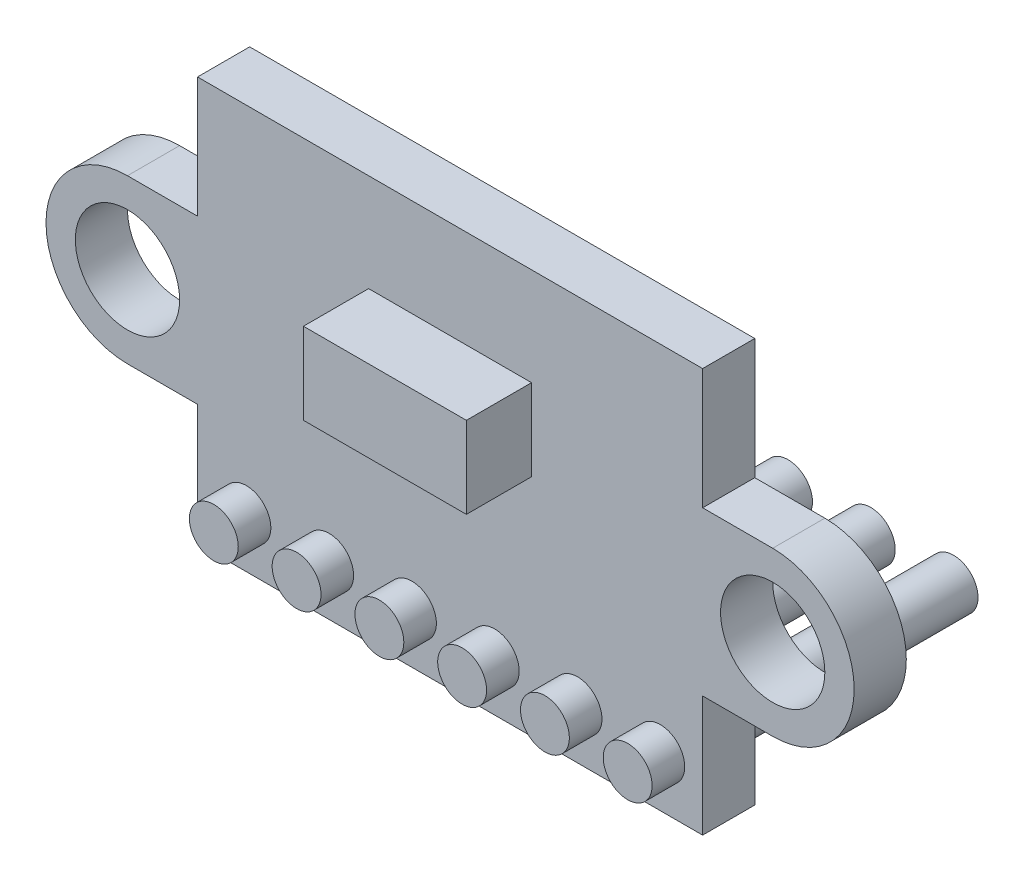
ISO-10303-21;
HEADER;
FILE_DESCRIPTION(('STEP AP214'),'2;1');
FILE_NAME('part.step','',(''),(''),'','','');
FILE_SCHEMA(('AUTOMOTIVE_DESIGN { 1 0 10303 214 1 1 1 1 }'));
ENDSEC;
DATA;
#1=APPLICATION_CONTEXT('core data for automotive mechanical design processes');
#2=APPLICATION_PROTOCOL_DEFINITION('international standard','automotive_design',2000,#1);
#3=PRODUCT_CONTEXT('',#1,'mechanical');
#4=PRODUCT('Part','Part','',(#3));
#5=PRODUCT_RELATED_PRODUCT_CATEGORY('part','',(#4));
#6=PRODUCT_DEFINITION_FORMATION('','',#4);
#7=PRODUCT_DEFINITION_CONTEXT('part definition',#1,'design');
#8=PRODUCT_DEFINITION('design','',#6,#7);
#9=PRODUCT_DEFINITION_SHAPE('','',#8);
#10=(LENGTH_UNIT() NAMED_UNIT(*) SI_UNIT(.MILLI.,.METRE.));
#11=(NAMED_UNIT(*) PLANE_ANGLE_UNIT() SI_UNIT($,.RADIAN.));
#12=(NAMED_UNIT(*) SI_UNIT($,.STERADIAN.) SOLID_ANGLE_UNIT());
#13=UNCERTAINTY_MEASURE_WITH_UNIT(LENGTH_MEASURE(1.E-05),#10,'distance_accuracy_value','');
#14=(GEOMETRIC_REPRESENTATION_CONTEXT(3) GLOBAL_UNCERTAINTY_ASSIGNED_CONTEXT((#13)) GLOBAL_UNIT_ASSIGNED_CONTEXT((#10,
#11,#12)) REPRESENTATION_CONTEXT('',''));
#15=CARTESIAN_POINT('',(0.,0.,0.));
#16=DIRECTION('',(0.,0.,1.));
#17=DIRECTION('',(1.,0.,0.));
#18=AXIS2_PLACEMENT_3D('',#15,#16,#17);
#19=CARTESIAN_POINT('',(-9.9,0.,1.6));
#20=DIRECTION('',(0.,0.,1.));
#21=DIRECTION('',(1.,0.,0.));
#22=AXIS2_PLACEMENT_3D('',#19,#20,#21);
#23=PLANE('',#22);
#24=CARTESIAN_POINT('',(6.45,-4.66,1.6));
#25=DIRECTION('',(0.,0.,1.));
#26=DIRECTION('',(1.,0.,0.));
#27=AXIS2_PLACEMENT_3D('',#24,#25,#26);
#28=CIRCLE('',#27,0.75);
#29=CARTESIAN_POINT('',(7.2,-4.66,1.6));
#30=VERTEX_POINT('',#29);
#31=EDGE_CURVE('E11',#30,#30,#28,.T.);
#32=ORIENTED_EDGE('',*,*,#31,.F.);
#33=EDGE_LOOP('',(#32));
#34=FACE_BOUND('',#33,.T.);
#35=CARTESIAN_POINT('',(3.91,-4.66,1.6));
#36=DIRECTION('',(0.,0.,1.));
#37=DIRECTION('',(1.,0.,0.));
#38=AXIS2_PLACEMENT_3D('',#35,#36,#37);
#39=CIRCLE('',#38,0.75);
#40=CARTESIAN_POINT('',(4.66,-4.66,1.6));
#41=VERTEX_POINT('',#40);
#42=EDGE_CURVE('E42',#41,#41,#39,.T.);
#43=ORIENTED_EDGE('',*,*,#42,.F.);
#44=EDGE_LOOP('',(#43));
#45=FACE_BOUND('',#44,.T.);
#46=CARTESIAN_POINT('',(1.37,-4.66,1.6));
#47=DIRECTION('',(0.,0.,1.));
#48=DIRECTION('',(1.,0.,0.));
#49=AXIS2_PLACEMENT_3D('',#46,#47,#48);
#50=CIRCLE('',#49,0.75);
#51=CARTESIAN_POINT('',(2.12,-4.66,1.6));
#52=VERTEX_POINT('',#51);
#53=EDGE_CURVE('E259',#52,#52,#50,.T.);
#54=ORIENTED_EDGE('',*,*,#53,.F.);
#55=EDGE_LOOP('',(#54));
#56=FACE_BOUND('',#55,.T.);
#57=CARTESIAN_POINT('',(-1.17,-4.66,1.6));
#58=DIRECTION('',(0.,0.,1.));
#59=DIRECTION('',(1.,0.,0.));
#60=AXIS2_PLACEMENT_3D('',#57,#58,#59);
#61=CIRCLE('',#60,0.75);
#62=CARTESIAN_POINT('',(-0.419999999999998,-4.66,1.6));
#63=VERTEX_POINT('',#62);
#64=EDGE_CURVE('E264',#63,#63,#61,.T.);
#65=ORIENTED_EDGE('',*,*,#64,.F.);
#66=EDGE_LOOP('',(#65));
#67=FACE_BOUND('',#66,.T.);
#68=CARTESIAN_POINT('',(-3.71,-4.66,1.6));
#69=DIRECTION('',(0.,0.,1.));
#70=DIRECTION('',(1.,0.,0.));
#71=AXIS2_PLACEMENT_3D('',#68,#69,#70);
#72=CIRCLE('',#71,0.75);
#73=CARTESIAN_POINT('',(-2.96,-4.66,1.6));
#74=VERTEX_POINT('',#73);
#75=EDGE_CURVE('E271',#74,#74,#72,.T.);
#76=ORIENTED_EDGE('',*,*,#75,.F.);
#77=EDGE_LOOP('',(#76));
#78=FACE_BOUND('',#77,.T.);
#79=CARTESIAN_POINT('',(-6.25,-4.66,1.6));
#80=DIRECTION('',(0.,0.,1.));
#81=DIRECTION('',(1.,0.,0.));
#82=AXIS2_PLACEMENT_3D('',#79,#80,#81);
#83=CIRCLE('',#82,0.75);
#84=CARTESIAN_POINT('',(-5.5,-4.66,1.6));
#85=VERTEX_POINT('',#84);
#86=EDGE_CURVE('E220',#85,#85,#83,.T.);
#87=ORIENTED_EDGE('',*,*,#86,.F.);
#88=EDGE_LOOP('',(#87));
#89=FACE_BOUND('',#88,.T.);
#90=CARTESIAN_POINT('',(9.9,0.,1.6));
#91=DIRECTION('',(0.,0.,1.));
#92=DIRECTION('',(1.,0.,0.));
#93=AXIS2_PLACEMENT_3D('',#90,#91,#92);
#94=CIRCLE('',#93,1.6);
#95=CARTESIAN_POINT('',(11.5,0.,1.6));
#96=VERTEX_POINT('',#95);
#97=EDGE_CURVE('E173',#96,#96,#94,.T.);
#98=ORIENTED_EDGE('',*,*,#97,.F.);
#99=EDGE_LOOP('',(#98));
#100=FACE_BOUND('',#99,.T.);
#101=DIRECTION('',(0.,-1.,0.));
#102=VECTOR('',#101,1.);
#103=CARTESIAN_POINT('',(-7.75,6.2,1.6));
#104=LINE('',#103,#102);
#105=CARTESIAN_POINT('',(-7.75,6.2,1.6));
#106=VERTEX_POINT('',#105);
#107=CARTESIAN_POINT('',(-7.75,2.5,1.6));
#108=VERTEX_POINT('',#107);
#109=EDGE_CURVE('E193',#106,#108,#104,.T.);
#110=ORIENTED_EDGE('',*,*,#109,.T.);
#111=DIRECTION('',(-1.,0.,0.));
#112=VECTOR('',#111,1.);
#113=CARTESIAN_POINT('',(-7.75,2.5,1.6));
#114=LINE('',#113,#112);
#115=CARTESIAN_POINT('',(-9.9,2.5,1.6));
#116=VERTEX_POINT('',#115);
#117=EDGE_CURVE('E113',#108,#116,#114,.T.);
#118=ORIENTED_EDGE('',*,*,#117,.T.);
#119=CARTESIAN_POINT('',(-9.9,0.,1.6));
#120=DIRECTION('',(0.,0.,1.));
#121=DIRECTION('',(1.,0.,0.));
#122=AXIS2_PLACEMENT_3D('',#119,#120,#121);
#123=CIRCLE('',#122,2.5);
#124=CARTESIAN_POINT('',(-9.9,-2.5,1.6));
#125=VERTEX_POINT('',#124);
#126=EDGE_CURVE('E328',#116,#125,#123,.T.);
#127=ORIENTED_EDGE('',*,*,#126,.T.);
#128=DIRECTION('',(1.,0.,0.));
#129=VECTOR('',#128,1.);
#130=CARTESIAN_POINT('',(-7.75,-2.5,1.6));
#131=LINE('',#130,#129);
#132=CARTESIAN_POINT('',(-7.75,-2.5,1.6));
#133=VERTEX_POINT('',#132);
#134=EDGE_CURVE('E330',#125,#133,#131,.T.);
#135=ORIENTED_EDGE('',*,*,#134,.T.);
#136=DIRECTION('',(0.,-1.,0.));
#137=VECTOR('',#136,1.);
#138=CARTESIAN_POINT('',(-7.75,-6.2,1.6));
#139=LINE('',#138,#137);
#140=CARTESIAN_POINT('',(-7.75,-6.2,1.6));
#141=VERTEX_POINT('',#140);
#142=EDGE_CURVE('E332',#133,#141,#139,.T.);
#143=ORIENTED_EDGE('',*,*,#142,.T.);
#144=DIRECTION('',(1.,0.,0.));
#145=VECTOR('',#144,1.);
#146=CARTESIAN_POINT('',(7.75,-6.2,1.6));
#147=LINE('',#146,#145);
#148=CARTESIAN_POINT('',(7.75,-6.2,1.6));
#149=VERTEX_POINT('',#148);
#150=EDGE_CURVE('E334',#141,#149,#147,.T.);
#151=ORIENTED_EDGE('',*,*,#150,.T.);
#152=DIRECTION('',(0.,1.,0.));
#153=VECTOR('',#152,1.);
#154=CARTESIAN_POINT('',(7.75,-2.5,1.6));
#155=LINE('',#154,#153);
#156=CARTESIAN_POINT('',(7.75,-2.5,1.6));
#157=VERTEX_POINT('',#156);
#158=EDGE_CURVE('E336',#149,#157,#155,.T.);
#159=ORIENTED_EDGE('',*,*,#158,.T.);
#160=DIRECTION('',(1.,0.,0.));
#161=VECTOR('',#160,1.);
#162=CARTESIAN_POINT('',(9.9,-2.5,1.6));
#163=LINE('',#162,#161);
#164=CARTESIAN_POINT('',(9.9,-2.5,1.6));
#165=VERTEX_POINT('',#164);
#166=EDGE_CURVE('E338',#157,#165,#163,.T.);
#167=ORIENTED_EDGE('',*,*,#166,.T.);
#168=CARTESIAN_POINT('',(9.9,0.,1.6));
#169=DIRECTION('',(0.,0.,1.));
#170=DIRECTION('',(-1.,0.,0.));
#171=AXIS2_PLACEMENT_3D('',#168,#169,#170);
#172=CIRCLE('',#171,2.5);
#173=CARTESIAN_POINT('',(9.9,2.5,1.6));
#174=VERTEX_POINT('',#173);
#175=EDGE_CURVE('E148',#165,#174,#172,.T.);
#176=ORIENTED_EDGE('',*,*,#175,.T.);
#177=DIRECTION('',(-1.,0.,0.));
#178=VECTOR('',#177,1.);
#179=CARTESIAN_POINT('',(7.74999999999999,2.5,1.6));
#180=LINE('',#179,#178);
#181=CARTESIAN_POINT('',(7.74999999999999,2.5,1.6));
#182=VERTEX_POINT('',#181);
#183=EDGE_CURVE('E141',#174,#182,#180,.T.);
#184=ORIENTED_EDGE('',*,*,#183,.T.);
#185=DIRECTION('',(0.,1.,0.));
#186=VECTOR('',#185,1.);
#187=CARTESIAN_POINT('',(7.74999999999999,6.2,1.6));
#188=LINE('',#187,#186);
#189=CARTESIAN_POINT('',(7.74999999999999,6.2,1.6));
#190=VERTEX_POINT('',#189);
#191=EDGE_CURVE('E145',#182,#190,#188,.T.);
#192=ORIENTED_EDGE('',*,*,#191,.T.);
#193=DIRECTION('',(-1.,0.,0.));
#194=VECTOR('',#193,1.);
#195=CARTESIAN_POINT('',(-7.75,6.2,1.6));
#196=LINE('',#195,#194);
#197=EDGE_CURVE('E59',#190,#106,#196,.T.);
#198=ORIENTED_EDGE('',*,*,#197,.T.);
#199=EDGE_LOOP('',(#110,#118,#127,#135,#143,#151,#159,#167,#176,#184,#192,#198));
#200=FACE_BOUND('',#199,.T.);
#201=CARTESIAN_POINT('',(-9.9,0.,1.6));
#202=DIRECTION('',(0.,0.,1.));
#203=DIRECTION('',(1.,0.,0.));
#204=AXIS2_PLACEMENT_3D('',#201,#202,#203);
#205=CIRCLE('',#204,1.6);
#206=CARTESIAN_POINT('',(-8.3,0.,1.6));
#207=VERTEX_POINT('',#206);
#208=EDGE_CURVE('E316',#207,#207,#205,.T.);
#209=ORIENTED_EDGE('',*,*,#208,.F.);
#210=EDGE_LOOP('',(#209));
#211=FACE_BOUND('',#210,.T.);
#212=DIRECTION('',(1.,0.,0.));
#213=VECTOR('',#212,1.);
#214=CARTESIAN_POINT('',(-2.5,0.7,1.6));
#215=LINE('',#214,#213);
#216=CARTESIAN_POINT('',(-2.5,0.7,1.6));
#217=VERTEX_POINT('',#216);
#218=CARTESIAN_POINT('',(2.5,0.7,1.6));
#219=VERTEX_POINT('',#218);
#220=EDGE_CURVE('E300',#217,#219,#215,.T.);
#221=ORIENTED_EDGE('',*,*,#220,.F.);
#222=DIRECTION('',(0.,-1.,0.));
#223=VECTOR('',#222,1.);
#224=CARTESIAN_POINT('',(-2.5,3.2,1.6));
#225=LINE('',#224,#223);
#226=CARTESIAN_POINT('',(-2.5,3.2,1.6));
#227=VERTEX_POINT('',#226);
#228=EDGE_CURVE('E224',#227,#217,#225,.T.);
#229=ORIENTED_EDGE('',*,*,#228,.F.);
#230=DIRECTION('',(-1.,0.,0.));
#231=VECTOR('',#230,1.);
#232=CARTESIAN_POINT('',(-2.5,3.2,1.6));
#233=LINE('',#232,#231);
#234=CARTESIAN_POINT('',(2.5,3.2,1.6));
#235=VERTEX_POINT('',#234);
#236=EDGE_CURVE('E288',#235,#227,#233,.T.);
#237=ORIENTED_EDGE('',*,*,#236,.F.);
#238=DIRECTION('',(0.,1.,0.));
#239=VECTOR('',#238,1.);
#240=CARTESIAN_POINT('',(2.5,3.2,1.6));
#241=LINE('',#240,#239);
#242=EDGE_CURVE('E303',#219,#235,#241,.T.);
#243=ORIENTED_EDGE('',*,*,#242,.F.);
#244=EDGE_LOOP('',(#221,#229,#237,#243));
#245=FACE_BOUND('',#244,.T.);
#246=ADVANCED_FACE('F33',(#34,#45,#56,#67,#78,#89,#100,#200,#211,#245),#23,.T.);
#247=CARTESIAN_POINT('',(-9.9,0.,0.));
#248=DIRECTION('',(0.,0.,1.));
#249=DIRECTION('',(1.,0.,0.));
#250=AXIS2_PLACEMENT_3D('',#247,#248,#249);
#251=PLANE('',#250);
#252=CARTESIAN_POINT('',(6.45,-4.66,0.));
#253=DIRECTION('',(0.,0.,1.));
#254=DIRECTION('',(1.,0.,0.));
#255=AXIS2_PLACEMENT_3D('',#252,#253,#254);
#256=CIRCLE('',#255,0.75);
#257=CARTESIAN_POINT('',(7.2,-4.66,0.));
#258=VERTEX_POINT('',#257);
#259=EDGE_CURVE('E37',#258,#258,#256,.T.);
#260=ORIENTED_EDGE('',*,*,#259,.T.);
#261=EDGE_LOOP('',(#260));
#262=FACE_BOUND('',#261,.T.);
#263=CARTESIAN_POINT('',(3.91,-4.66,0.));
#264=DIRECTION('',(0.,0.,1.));
#265=DIRECTION('',(1.,0.,0.));
#266=AXIS2_PLACEMENT_3D('',#263,#264,#265);
#267=CIRCLE('',#266,0.75);
#268=CARTESIAN_POINT('',(4.66,-4.66,0.));
#269=VERTEX_POINT('',#268);
#270=EDGE_CURVE('E240',#269,#269,#267,.T.);
#271=ORIENTED_EDGE('',*,*,#270,.T.);
#272=EDGE_LOOP('',(#271));
#273=FACE_BOUND('',#272,.T.);
#274=CARTESIAN_POINT('',(1.37,-4.66,0.));
#275=DIRECTION('',(0.,0.,1.));
#276=DIRECTION('',(1.,0.,0.));
#277=AXIS2_PLACEMENT_3D('',#274,#275,#276);
#278=CIRCLE('',#277,0.75);
#279=CARTESIAN_POINT('',(2.12,-4.66,0.));
#280=VERTEX_POINT('',#279);
#281=EDGE_CURVE('E236',#280,#280,#278,.T.);
#282=ORIENTED_EDGE('',*,*,#281,.T.);
#283=EDGE_LOOP('',(#282));
#284=FACE_BOUND('',#283,.T.);
#285=CARTESIAN_POINT('',(-1.17,-4.66,0.));
#286=DIRECTION('',(0.,0.,1.));
#287=DIRECTION('',(1.,0.,0.));
#288=AXIS2_PLACEMENT_3D('',#285,#286,#287);
#289=CIRCLE('',#288,0.75);
#290=CARTESIAN_POINT('',(-0.419999999999998,-4.66,0.));
#291=VERTEX_POINT('',#290);
#292=EDGE_CURVE('E231',#291,#291,#289,.T.);
#293=ORIENTED_EDGE('',*,*,#292,.T.);
#294=EDGE_LOOP('',(#293));
#295=FACE_BOUND('',#294,.T.);
#296=CARTESIAN_POINT('',(-3.71,-4.66,0.));
#297=DIRECTION('',(0.,0.,1.));
#298=DIRECTION('',(1.,0.,0.));
#299=AXIS2_PLACEMENT_3D('',#296,#297,#298);
#300=CIRCLE('',#299,0.75);
#301=CARTESIAN_POINT('',(-2.96,-4.66,0.));
#302=VERTEX_POINT('',#301);
#303=EDGE_CURVE('E226',#302,#302,#300,.T.);
#304=ORIENTED_EDGE('',*,*,#303,.T.);
#305=EDGE_LOOP('',(#304));
#306=FACE_BOUND('',#305,.T.);
#307=CARTESIAN_POINT('',(-6.25,-4.66,0.));
#308=DIRECTION('',(0.,0.,1.));
#309=DIRECTION('',(1.,0.,0.));
#310=AXIS2_PLACEMENT_3D('',#307,#308,#309);
#311=CIRCLE('',#310,0.75);
#312=CARTESIAN_POINT('',(-5.5,-4.66,0.));
#313=VERTEX_POINT('',#312);
#314=EDGE_CURVE('E221',#313,#313,#311,.T.);
#315=ORIENTED_EDGE('',*,*,#314,.T.);
#316=EDGE_LOOP('',(#315));
#317=FACE_BOUND('',#316,.T.);
#318=DIRECTION('',(0.,-1.,0.));
#319=VECTOR('',#318,1.);
#320=CARTESIAN_POINT('',(-7.75,6.2,0.));
#321=LINE('',#320,#319);
#322=CARTESIAN_POINT('',(-7.75,6.2,0.));
#323=VERTEX_POINT('',#322);
#324=CARTESIAN_POINT('',(-7.75,2.5,0.));
#325=VERTEX_POINT('',#324);
#326=EDGE_CURVE('E169',#323,#325,#321,.T.);
#327=ORIENTED_EDGE('',*,*,#326,.F.);
#328=DIRECTION('',(-1.,0.,0.));
#329=VECTOR('',#328,1.);
#330=CARTESIAN_POINT('',(-7.75,6.2,0.));
#331=LINE('',#330,#329);
#332=CARTESIAN_POINT('',(7.74999999999999,6.2,0.));
#333=VERTEX_POINT('',#332);
#334=EDGE_CURVE('E104',#333,#323,#331,.T.);
#335=ORIENTED_EDGE('',*,*,#334,.F.);
#336=DIRECTION('',(0.,1.,0.));
#337=VECTOR('',#336,1.);
#338=CARTESIAN_POINT('',(7.74999999999999,6.2,0.));
#339=LINE('',#338,#337);
#340=CARTESIAN_POINT('',(7.74999999999999,2.5,0.));
#341=VERTEX_POINT('',#340);
#342=EDGE_CURVE('E190',#341,#333,#339,.T.);
#343=ORIENTED_EDGE('',*,*,#342,.F.);
#344=DIRECTION('',(-1.,0.,0.));
#345=VECTOR('',#344,1.);
#346=CARTESIAN_POINT('',(7.74999999999999,2.5,0.));
#347=LINE('',#346,#345);
#348=CARTESIAN_POINT('',(9.9,2.5,0.));
#349=VERTEX_POINT('',#348);
#350=EDGE_CURVE('E157',#349,#341,#347,.T.);
#351=ORIENTED_EDGE('',*,*,#350,.F.);
#352=CARTESIAN_POINT('',(9.9,0.,0.));
#353=DIRECTION('',(0.,0.,1.));
#354=DIRECTION('',(-1.,0.,0.));
#355=AXIS2_PLACEMENT_3D('',#352,#353,#354);
#356=CIRCLE('',#355,2.5);
#357=CARTESIAN_POINT('',(9.9,-2.5,0.));
#358=VERTEX_POINT('',#357);
#359=EDGE_CURVE('E187',#358,#349,#356,.T.);
#360=ORIENTED_EDGE('',*,*,#359,.F.);
#361=DIRECTION('',(1.,0.,0.));
#362=VECTOR('',#361,1.);
#363=CARTESIAN_POINT('',(9.9,-2.5,0.));
#364=LINE('',#363,#362);
#365=CARTESIAN_POINT('',(7.75,-2.5,0.));
#366=VERTEX_POINT('',#365);
#367=EDGE_CURVE('E185',#366,#358,#364,.T.);
#368=ORIENTED_EDGE('',*,*,#367,.F.);
#369=DIRECTION('',(0.,1.,0.));
#370=VECTOR('',#369,1.);
#371=CARTESIAN_POINT('',(7.75,-2.5,0.));
#372=LINE('',#371,#370);
#373=CARTESIAN_POINT('',(7.75,-6.2,0.));
#374=VERTEX_POINT('',#373);
#375=EDGE_CURVE('E183',#374,#366,#372,.T.);
#376=ORIENTED_EDGE('',*,*,#375,.F.);
#377=DIRECTION('',(1.,0.,0.));
#378=VECTOR('',#377,1.);
#379=CARTESIAN_POINT('',(7.75,-6.2,0.));
#380=LINE('',#379,#378);
#381=CARTESIAN_POINT('',(-7.75,-6.2,0.));
#382=VERTEX_POINT('',#381);
#383=EDGE_CURVE('E181',#382,#374,#380,.T.);
#384=ORIENTED_EDGE('',*,*,#383,.F.);
#385=DIRECTION('',(0.,-1.,0.));
#386=VECTOR('',#385,1.);
#387=CARTESIAN_POINT('',(-7.75,-6.2,0.));
#388=LINE('',#387,#386);
#389=CARTESIAN_POINT('',(-7.75,-2.5,0.));
#390=VERTEX_POINT('',#389);
#391=EDGE_CURVE('E179',#390,#382,#388,.T.);
#392=ORIENTED_EDGE('',*,*,#391,.F.);
#393=DIRECTION('',(1.,0.,0.));
#394=VECTOR('',#393,1.);
#395=CARTESIAN_POINT('',(-7.75,-2.5,0.));
#396=LINE('',#395,#394);
#397=CARTESIAN_POINT('',(-9.9,-2.5,0.));
#398=VERTEX_POINT('',#397);
#399=EDGE_CURVE('E177',#398,#390,#396,.T.);
#400=ORIENTED_EDGE('',*,*,#399,.F.);
#401=CARTESIAN_POINT('',(-9.9,0.,0.));
#402=DIRECTION('',(0.,0.,1.));
#403=DIRECTION('',(1.,0.,0.));
#404=AXIS2_PLACEMENT_3D('',#401,#402,#403);
#405=CIRCLE('',#404,2.5);
#406=CARTESIAN_POINT('',(-9.9,2.5,0.));
#407=VERTEX_POINT('',#406);
#408=EDGE_CURVE('E175',#407,#398,#405,.T.);
#409=ORIENTED_EDGE('',*,*,#408,.F.);
#410=DIRECTION('',(-1.,0.,0.));
#411=VECTOR('',#410,1.);
#412=CARTESIAN_POINT('',(-7.75,2.5,0.));
#413=LINE('',#412,#411);
#414=EDGE_CURVE('E172',#325,#407,#413,.T.);
#415=ORIENTED_EDGE('',*,*,#414,.F.);
#416=EDGE_LOOP('',(#327,#335,#343,#351,#360,#368,#376,#384,#392,#400,#409,#415));
#417=FACE_BOUND('',#416,.T.);
#418=CARTESIAN_POINT('',(9.9,0.,0.));
#419=DIRECTION('',(0.,0.,1.));
#420=DIRECTION('',(1.,0.,0.));
#421=AXIS2_PLACEMENT_3D('',#418,#419,#420);
#422=CIRCLE('',#421,1.6);
#423=CARTESIAN_POINT('',(11.5,0.,0.));
#424=VERTEX_POINT('',#423);
#425=EDGE_CURVE('E319',#424,#424,#422,.T.);
#426=ORIENTED_EDGE('',*,*,#425,.T.);
#427=EDGE_LOOP('',(#426));
#428=FACE_BOUND('',#427,.T.);
#429=CARTESIAN_POINT('',(-9.9,0.,0.));
#430=DIRECTION('',(0.,0.,1.));
#431=DIRECTION('',(1.,0.,0.));
#432=AXIS2_PLACEMENT_3D('',#429,#430,#431);
#433=CIRCLE('',#432,1.6);
#434=CARTESIAN_POINT('',(-8.3,0.,0.));
#435=VERTEX_POINT('',#434);
#436=EDGE_CURVE('E315',#435,#435,#433,.T.);
#437=ORIENTED_EDGE('',*,*,#436,.T.);
#438=EDGE_LOOP('',(#437));
#439=FACE_BOUND('',#438,.T.);
#440=ADVANCED_FACE('F351',(#262,#273,#284,#295,#306,#317,#417,#428,#439),#251,.F.);
#441=CARTESIAN_POINT('',(-7.75,6.2,1.6));
#442=DIRECTION('',(1.,0.,0.));
#443=DIRECTION('',(0.,0.,-1.));
#444=AXIS2_PLACEMENT_3D('',#441,#442,#443);
#445=PLANE('',#444);
#446=ORIENTED_EDGE('',*,*,#326,.T.);
#447=DIRECTION('',(0.,0.,-1.));
#448=VECTOR('',#447,1.);
#449=CARTESIAN_POINT('',(-7.75,2.5,1.6));
#450=LINE('',#449,#448);
#451=EDGE_CURVE('E218',#108,#325,#450,.T.);
#452=ORIENTED_EDGE('',*,*,#451,.F.);
#453=ORIENTED_EDGE('',*,*,#109,.F.);
#454=DIRECTION('',(0.,0.,-1.));
#455=VECTOR('',#454,1.);
#456=CARTESIAN_POINT('',(-7.75,6.2,1.6));
#457=LINE('',#456,#455);
#458=EDGE_CURVE('E165',#106,#323,#457,.T.);
#459=ORIENTED_EDGE('',*,*,#458,.T.);
#460=EDGE_LOOP('',(#446,#452,#453,#459));
#461=FACE_BOUND('',#460,.T.);
#462=ADVANCED_FACE('F35',(#461),#445,.F.);
#463=CARTESIAN_POINT('',(-7.75,2.5,1.6));
#464=DIRECTION('',(0.,-1.,0.));
#465=DIRECTION('',(0.,0.,-1.));
#466=AXIS2_PLACEMENT_3D('',#463,#464,#465);
#467=PLANE('',#466);
#468=ORIENTED_EDGE('',*,*,#414,.T.);
#469=DIRECTION('',(0.,0.,-1.));
#470=VECTOR('',#469,1.);
#471=CARTESIAN_POINT('',(-9.9,2.5,1.6));
#472=LINE('',#471,#470);
#473=EDGE_CURVE('E215',#116,#407,#472,.T.);
#474=ORIENTED_EDGE('',*,*,#473,.F.);
#475=ORIENTED_EDGE('',*,*,#117,.F.);
#476=ORIENTED_EDGE('',*,*,#451,.T.);
#477=EDGE_LOOP('',(#468,#474,#475,#476));
#478=FACE_BOUND('',#477,.T.);
#479=ADVANCED_FACE('F359',(#478),#467,.F.);
#480=CARTESIAN_POINT('',(-9.9,0.,1.6));
#481=DIRECTION('',(0.,0.,-1.));
#482=DIRECTION('',(-1.,0.,0.));
#483=AXIS2_PLACEMENT_3D('',#480,#481,#482);
#484=CYLINDRICAL_SURFACE('',#483,2.5);
#485=ORIENTED_EDGE('',*,*,#408,.T.);
#486=DIRECTION('',(0.,0.,-1.));
#487=VECTOR('',#486,1.);
#488=CARTESIAN_POINT('',(-9.9,-2.5,1.6));
#489=LINE('',#488,#487);
#490=EDGE_CURVE('E212',#125,#398,#489,.T.);
#491=ORIENTED_EDGE('',*,*,#490,.F.);
#492=ORIENTED_EDGE('',*,*,#126,.F.);
#493=ORIENTED_EDGE('',*,*,#473,.T.);
#494=EDGE_LOOP('',(#485,#491,#492,#493));
#495=FACE_BOUND('',#494,.T.);
#496=ADVANCED_FACE('F362',(#495),#484,.T.);
#497=CARTESIAN_POINT('',(-7.75,-2.5,1.6));
#498=DIRECTION('',(0.,1.,0.));
#499=DIRECTION('',(0.,0.,1.));
#500=AXIS2_PLACEMENT_3D('',#497,#498,#499);
#501=PLANE('',#500);
#502=ORIENTED_EDGE('',*,*,#399,.T.);
#503=DIRECTION('',(0.,0.,-1.));
#504=VECTOR('',#503,1.);
#505=CARTESIAN_POINT('',(-7.75,-2.5,1.6));
#506=LINE('',#505,#504);
#507=EDGE_CURVE('E209',#133,#390,#506,.T.);
#508=ORIENTED_EDGE('',*,*,#507,.F.);
#509=ORIENTED_EDGE('',*,*,#134,.F.);
#510=ORIENTED_EDGE('',*,*,#490,.T.);
#511=EDGE_LOOP('',(#502,#508,#509,#510));
#512=FACE_BOUND('',#511,.T.);
#513=ADVANCED_FACE('F367',(#512),#501,.F.);
#514=CARTESIAN_POINT('',(-7.75,-6.2,1.6));
#515=DIRECTION('',(1.,0.,0.));
#516=DIRECTION('',(0.,0.,-1.));
#517=AXIS2_PLACEMENT_3D('',#514,#515,#516);
#518=PLANE('',#517);
#519=ORIENTED_EDGE('',*,*,#391,.T.);
#520=DIRECTION('',(0.,0.,-1.));
#521=VECTOR('',#520,1.);
#522=CARTESIAN_POINT('',(-7.75,-6.2,1.6));
#523=LINE('',#522,#521);
#524=EDGE_CURVE('E206',#141,#382,#523,.T.);
#525=ORIENTED_EDGE('',*,*,#524,.F.);
#526=ORIENTED_EDGE('',*,*,#142,.F.);
#527=ORIENTED_EDGE('',*,*,#507,.T.);
#528=EDGE_LOOP('',(#519,#525,#526,#527));
#529=FACE_BOUND('',#528,.T.);
#530=ADVANCED_FACE('F373',(#529),#518,.F.);
#531=CARTESIAN_POINT('',(7.75,-6.2,1.6));
#532=DIRECTION('',(0.,1.,0.));
#533=DIRECTION('',(0.,0.,1.));
#534=AXIS2_PLACEMENT_3D('',#531,#532,#533);
#535=PLANE('',#534);
#536=ORIENTED_EDGE('',*,*,#383,.T.);
#537=DIRECTION('',(0.,0.,-1.));
#538=VECTOR('',#537,1.);
#539=CARTESIAN_POINT('',(7.75,-6.2,1.6));
#540=LINE('',#539,#538);
#541=EDGE_CURVE('E203',#149,#374,#540,.T.);
#542=ORIENTED_EDGE('',*,*,#541,.F.);
#543=ORIENTED_EDGE('',*,*,#150,.F.);
#544=ORIENTED_EDGE('',*,*,#524,.T.);
#545=EDGE_LOOP('',(#536,#542,#543,#544));
#546=FACE_BOUND('',#545,.T.);
#547=ADVANCED_FACE('F377',(#546),#535,.F.);
#548=CARTESIAN_POINT('',(7.75,-2.5,1.6));
#549=DIRECTION('',(-1.,0.,0.));
#550=DIRECTION('',(0.,0.,1.));
#551=AXIS2_PLACEMENT_3D('',#548,#549,#550);
#552=PLANE('',#551);
#553=ORIENTED_EDGE('',*,*,#375,.T.);
#554=DIRECTION('',(0.,0.,-1.));
#555=VECTOR('',#554,1.);
#556=CARTESIAN_POINT('',(7.75,-2.5,1.6));
#557=LINE('',#556,#555);
#558=EDGE_CURVE('E200',#157,#366,#557,.T.);
#559=ORIENTED_EDGE('',*,*,#558,.F.);
#560=ORIENTED_EDGE('',*,*,#158,.F.);
#561=ORIENTED_EDGE('',*,*,#541,.T.);
#562=EDGE_LOOP('',(#553,#559,#560,#561));
#563=FACE_BOUND('',#562,.T.);
#564=ADVANCED_FACE('F380',(#563),#552,.F.);
#565=CARTESIAN_POINT('',(9.9,-2.5,1.6));
#566=DIRECTION('',(0.,1.,0.));
#567=DIRECTION('',(0.,0.,1.));
#568=AXIS2_PLACEMENT_3D('',#565,#566,#567);
#569=PLANE('',#568);
#570=ORIENTED_EDGE('',*,*,#367,.T.);
#571=DIRECTION('',(0.,0.,-1.));
#572=VECTOR('',#571,1.);
#573=CARTESIAN_POINT('',(9.9,-2.5,1.6));
#574=LINE('',#573,#572);
#575=EDGE_CURVE('E197',#165,#358,#574,.T.);
#576=ORIENTED_EDGE('',*,*,#575,.F.);
#577=ORIENTED_EDGE('',*,*,#166,.F.);
#578=ORIENTED_EDGE('',*,*,#558,.T.);
#579=EDGE_LOOP('',(#570,#576,#577,#578));
#580=FACE_BOUND('',#579,.T.);
#581=ADVANCED_FACE('F344',(#580),#569,.F.);
#582=CARTESIAN_POINT('',(9.9,0.,1.6));
#583=DIRECTION('',(0.,0.,-1.));
#584=DIRECTION('',(-1.,0.,0.));
#585=AXIS2_PLACEMENT_3D('',#582,#583,#584);
#586=CYLINDRICAL_SURFACE('',#585,2.5);
#587=ORIENTED_EDGE('',*,*,#359,.T.);
#588=DIRECTION('',(0.,0.,-1.));
#589=VECTOR('',#588,1.);
#590=CARTESIAN_POINT('',(9.9,2.5,1.6));
#591=LINE('',#590,#589);
#592=EDGE_CURVE('E160',#174,#349,#591,.T.);
#593=ORIENTED_EDGE('',*,*,#592,.F.);
#594=ORIENTED_EDGE('',*,*,#175,.F.);
#595=ORIENTED_EDGE('',*,*,#575,.T.);
#596=EDGE_LOOP('',(#587,#593,#594,#595));
#597=FACE_BOUND('',#596,.T.);
#598=ADVANCED_FACE('F348',(#597),#586,.T.);
#599=CARTESIAN_POINT('',(7.74999999999999,2.5,1.6));
#600=DIRECTION('',(0.,-1.,0.));
#601=DIRECTION('',(0.,0.,-1.));
#602=AXIS2_PLACEMENT_3D('',#599,#600,#601);
#603=PLANE('',#602);
#604=ORIENTED_EDGE('',*,*,#350,.T.);
#605=DIRECTION('',(0.,0.,-1.));
#606=VECTOR('',#605,1.);
#607=CARTESIAN_POINT('',(7.74999999999999,2.5,1.6));
#608=LINE('',#607,#606);
#609=EDGE_CURVE('E154',#182,#341,#608,.T.);
#610=ORIENTED_EDGE('',*,*,#609,.F.);
#611=ORIENTED_EDGE('',*,*,#183,.F.);
#612=ORIENTED_EDGE('',*,*,#592,.T.);
#613=EDGE_LOOP('',(#604,#610,#611,#612));
#614=FACE_BOUND('',#613,.T.);
#615=ADVANCED_FACE('F155',(#614),#603,.F.);
#616=CARTESIAN_POINT('',(7.74999999999999,6.2,1.6));
#617=DIRECTION('',(-1.,0.,0.));
#618=DIRECTION('',(0.,0.,1.));
#619=AXIS2_PLACEMENT_3D('',#616,#617,#618);
#620=PLANE('',#619);
#621=ORIENTED_EDGE('',*,*,#342,.T.);
#622=DIRECTION('',(0.,0.,-1.));
#623=VECTOR('',#622,1.);
#624=CARTESIAN_POINT('',(7.74999999999999,6.2,1.6));
#625=LINE('',#624,#623);
#626=EDGE_CURVE('E161',#190,#333,#625,.T.);
#627=ORIENTED_EDGE('',*,*,#626,.F.);
#628=ORIENTED_EDGE('',*,*,#191,.F.);
#629=ORIENTED_EDGE('',*,*,#609,.T.);
#630=EDGE_LOOP('',(#621,#627,#628,#629));
#631=FACE_BOUND('',#630,.T.);
#632=ADVANCED_FACE('F163',(#631),#620,.F.);
#633=CARTESIAN_POINT('',(-7.75,6.2,1.6));
#634=DIRECTION('',(0.,-1.,0.));
#635=DIRECTION('',(0.,0.,-1.));
#636=AXIS2_PLACEMENT_3D('',#633,#634,#635);
#637=PLANE('',#636);
#638=ORIENTED_EDGE('',*,*,#334,.T.);
#639=ORIENTED_EDGE('',*,*,#458,.F.);
#640=ORIENTED_EDGE('',*,*,#197,.F.);
#641=ORIENTED_EDGE('',*,*,#626,.T.);
#642=EDGE_LOOP('',(#638,#639,#640,#641));
#643=FACE_BOUND('',#642,.T.);
#644=ADVANCED_FACE('F353',(#643),#637,.F.);
#645=CARTESIAN_POINT('',(9.9,0.,1.6));
#646=DIRECTION('',(0.,0.,-1.));
#647=DIRECTION('',(-1.,0.,0.));
#648=AXIS2_PLACEMENT_3D('',#645,#646,#647);
#649=CYLINDRICAL_SURFACE('',#648,1.6);
#650=ORIENTED_EDGE('',*,*,#97,.T.);
#651=EDGE_LOOP('',(#650));
#652=FACE_BOUND('',#651,.T.);
#653=ORIENTED_EDGE('',*,*,#425,.F.);
#654=EDGE_LOOP('',(#653));
#655=FACE_BOUND('',#654,.T.);
#656=ADVANCED_FACE('F400',(#652,#655),#649,.F.);
#657=CARTESIAN_POINT('',(-9.9,0.,1.6));
#658=DIRECTION('',(0.,0.,-1.));
#659=DIRECTION('',(-1.,0.,0.));
#660=AXIS2_PLACEMENT_3D('',#657,#658,#659);
#661=CYLINDRICAL_SURFACE('',#660,1.6);
#662=ORIENTED_EDGE('',*,*,#208,.T.);
#663=EDGE_LOOP('',(#662));
#664=FACE_BOUND('',#663,.T.);
#665=ORIENTED_EDGE('',*,*,#436,.F.);
#666=EDGE_LOOP('',(#665));
#667=FACE_BOUND('',#666,.T.);
#668=ADVANCED_FACE('F432',(#664,#667),#661,.F.);
#669=CARTESIAN_POINT('',(-2.5,3.2,3.6));
#670=DIRECTION('',(1.,0.,0.));
#671=DIRECTION('',(0.,1.,0.));
#672=AXIS2_PLACEMENT_3D('',#669,#670,#671);
#673=PLANE('',#672);
#674=ORIENTED_EDGE('',*,*,#228,.T.);
#675=DIRECTION('',(0.,0.,-1.));
#676=VECTOR('',#675,1.);
#677=CARTESIAN_POINT('',(-2.5,0.7,3.6));
#678=LINE('',#677,#676);
#679=CARTESIAN_POINT('',(-2.5,0.7,3.6));
#680=VERTEX_POINT('',#679);
#681=EDGE_CURVE('E312',#680,#217,#678,.T.);
#682=ORIENTED_EDGE('',*,*,#681,.F.);
#683=DIRECTION('',(0.,-1.,0.));
#684=VECTOR('',#683,1.);
#685=CARTESIAN_POINT('',(-2.5,3.2,3.6));
#686=LINE('',#685,#684);
#687=CARTESIAN_POINT('',(-2.5,3.2,3.6));
#688=VERTEX_POINT('',#687);
#689=EDGE_CURVE('E284',#688,#680,#686,.T.);
#690=ORIENTED_EDGE('',*,*,#689,.F.);
#691=DIRECTION('',(0.,0.,-1.));
#692=VECTOR('',#691,1.);
#693=CARTESIAN_POINT('',(-2.5,3.2,3.6));
#694=LINE('',#693,#692);
#695=EDGE_CURVE('E297',#688,#227,#694,.T.);
#696=ORIENTED_EDGE('',*,*,#695,.T.);
#697=EDGE_LOOP('',(#674,#682,#690,#696));
#698=FACE_BOUND('',#697,.T.);
#699=ADVANCED_FACE('F439',(#698),#673,.F.);
#700=CARTESIAN_POINT('',(-2.5,0.7,3.6));
#701=DIRECTION('',(0.,1.,0.));
#702=DIRECTION('',(0.,0.,1.));
#703=AXIS2_PLACEMENT_3D('',#700,#701,#702);
#704=PLANE('',#703);
#705=ORIENTED_EDGE('',*,*,#220,.T.);
#706=DIRECTION('',(0.,0.,-1.));
#707=VECTOR('',#706,1.);
#708=CARTESIAN_POINT('',(2.5,0.7,3.6));
#709=LINE('',#708,#707);
#710=CARTESIAN_POINT('',(2.5,0.7,3.6));
#711=VERTEX_POINT('',#710);
#712=EDGE_CURVE('E309',#711,#219,#709,.T.);
#713=ORIENTED_EDGE('',*,*,#712,.F.);
#714=DIRECTION('',(1.,0.,0.));
#715=VECTOR('',#714,1.);
#716=CARTESIAN_POINT('',(-2.5,0.7,3.6));
#717=LINE('',#716,#715);
#718=EDGE_CURVE('E287',#680,#711,#717,.T.);
#719=ORIENTED_EDGE('',*,*,#718,.F.);
#720=ORIENTED_EDGE('',*,*,#681,.T.);
#721=EDGE_LOOP('',(#705,#713,#719,#720));
#722=FACE_BOUND('',#721,.T.);
#723=ADVANCED_FACE('F446',(#722),#704,.F.);
#724=CARTESIAN_POINT('',(2.5,3.2,3.6));
#725=DIRECTION('',(-1.,0.,0.));
#726=DIRECTION('',(0.,-1.,0.));
#727=AXIS2_PLACEMENT_3D('',#724,#725,#726);
#728=PLANE('',#727);
#729=ORIENTED_EDGE('',*,*,#242,.T.);
#730=DIRECTION('',(0.,0.,-1.));
#731=VECTOR('',#730,1.);
#732=CARTESIAN_POINT('',(2.5,3.2,3.6));
#733=LINE('',#732,#731);
#734=CARTESIAN_POINT('',(2.5,3.2,3.6));
#735=VERTEX_POINT('',#734);
#736=EDGE_CURVE('E50',#735,#235,#733,.T.);
#737=ORIENTED_EDGE('',*,*,#736,.F.);
#738=DIRECTION('',(0.,1.,0.));
#739=VECTOR('',#738,1.);
#740=CARTESIAN_POINT('',(2.5,3.2,3.6));
#741=LINE('',#740,#739);
#742=EDGE_CURVE('E291',#711,#735,#741,.T.);
#743=ORIENTED_EDGE('',*,*,#742,.F.);
#744=ORIENTED_EDGE('',*,*,#712,.T.);
#745=EDGE_LOOP('',(#729,#737,#743,#744));
#746=FACE_BOUND('',#745,.T.);
#747=ADVANCED_FACE('F454',(#746),#728,.F.);
#748=CARTESIAN_POINT('',(-2.5,3.2,3.6));
#749=DIRECTION('',(0.,-1.,0.));
#750=DIRECTION('',(0.,0.,-1.));
#751=AXIS2_PLACEMENT_3D('',#748,#749,#750);
#752=PLANE('',#751);
#753=ORIENTED_EDGE('',*,*,#236,.T.);
#754=ORIENTED_EDGE('',*,*,#695,.F.);
#755=DIRECTION('',(-1.,0.,0.));
#756=VECTOR('',#755,1.);
#757=CARTESIAN_POINT('',(-2.5,3.2,3.6));
#758=LINE('',#757,#756);
#759=EDGE_CURVE('E294',#735,#688,#758,.T.);
#760=ORIENTED_EDGE('',*,*,#759,.F.);
#761=ORIENTED_EDGE('',*,*,#736,.T.);
#762=EDGE_LOOP('',(#753,#754,#760,#761));
#763=FACE_BOUND('',#762,.T.);
#764=ADVANCED_FACE('F462',(#763),#752,.F.);
#765=CARTESIAN_POINT('',(0.,0.,3.6));
#766=DIRECTION('',(0.,0.,1.));
#767=DIRECTION('',(1.,0.,0.));
#768=AXIS2_PLACEMENT_3D('',#765,#766,#767);
#769=PLANE('',#768);
#770=ORIENTED_EDGE('',*,*,#689,.T.);
#771=ORIENTED_EDGE('',*,*,#718,.T.);
#772=ORIENTED_EDGE('',*,*,#742,.T.);
#773=ORIENTED_EDGE('',*,*,#759,.T.);
#774=EDGE_LOOP('',(#770,#771,#772,#773));
#775=FACE_BOUND('',#774,.T.);
#776=ADVANCED_FACE('F470',(#775),#769,.T.);
#777=CARTESIAN_POINT('',(-6.25,-4.66,-7.4));
#778=DIRECTION('',(0.,0.,1.));
#779=DIRECTION('',(1.,0.,0.));
#780=AXIS2_PLACEMENT_3D('',#777,#778,#779);
#781=PLANE('',#780);
#782=CARTESIAN_POINT('',(-6.25,-4.66,-7.4));
#783=DIRECTION('',(0.,0.,1.));
#784=DIRECTION('',(1.,0.,0.));
#785=AXIS2_PLACEMENT_3D('',#782,#783,#784);
#786=CIRCLE('',#785,0.75);
#787=CARTESIAN_POINT('',(-5.5,-4.66,-7.4));
#788=VERTEX_POINT('',#787);
#789=EDGE_CURVE('E225',#788,#788,#786,.T.);
#790=ORIENTED_EDGE('',*,*,#789,.F.);
#791=EDGE_LOOP('',(#790));
#792=FACE_BOUND('',#791,.T.);
#793=ADVANCED_FACE('F477',(#792),#781,.F.);
#794=CARTESIAN_POINT('',(-6.25,-4.66,-7.4));
#795=DIRECTION('',(0.,0.,1.));
#796=DIRECTION('',(1.,0.,0.));
#797=AXIS2_PLACEMENT_3D('',#794,#795,#796);
#798=CYLINDRICAL_SURFACE('',#797,0.75);
#799=ORIENTED_EDGE('',*,*,#789,.T.);
#800=EDGE_LOOP('',(#799));
#801=FACE_BOUND('',#800,.T.);
#802=ORIENTED_EDGE('',*,*,#314,.F.);
#803=EDGE_LOOP('',(#802));
#804=FACE_BOUND('',#803,.T.);
#805=ADVANCED_FACE('F485',(#801,#804),#798,.T.);
#806=ORIENTED_EDGE('',*,*,#86,.T.);
#807=EDGE_LOOP('',(#806));
#808=FACE_BOUND('',#807,.T.);
#809=CARTESIAN_POINT('',(-6.25,-4.66,2.6));
#810=DIRECTION('',(0.,0.,1.));
#811=DIRECTION('',(1.,0.,0.));
#812=AXIS2_PLACEMENT_3D('',#809,#810,#811);
#813=CIRCLE('',#812,0.75);
#814=CARTESIAN_POINT('',(-5.5,-4.66,2.6));
#815=VERTEX_POINT('',#814);
#816=EDGE_CURVE('E229',#815,#815,#813,.T.);
#817=ORIENTED_EDGE('',*,*,#816,.F.);
#818=EDGE_LOOP('',(#817));
#819=FACE_BOUND('',#818,.T.);
#820=ADVANCED_FACE('F493',(#808,#819),#798,.T.);
#821=CARTESIAN_POINT('',(-6.25,-4.66,2.6));
#822=DIRECTION('',(0.,0.,1.));
#823=DIRECTION('',(1.,0.,0.));
#824=AXIS2_PLACEMENT_3D('',#821,#822,#823);
#825=PLANE('',#824);
#826=ORIENTED_EDGE('',*,*,#816,.T.);
#827=EDGE_LOOP('',(#826));
#828=FACE_BOUND('',#827,.T.);
#829=ADVANCED_FACE('F501',(#828),#825,.T.);
#830=CARTESIAN_POINT('',(-3.71,-4.66,-7.4));
#831=DIRECTION('',(0.,0.,1.));
#832=DIRECTION('',(1.,0.,0.));
#833=AXIS2_PLACEMENT_3D('',#830,#831,#832);
#834=PLANE('',#833);
#835=CARTESIAN_POINT('',(-3.71,-4.66,-7.4));
#836=DIRECTION('',(0.,0.,1.));
#837=DIRECTION('',(1.,0.,0.));
#838=AXIS2_PLACEMENT_3D('',#835,#836,#837);
#839=CIRCLE('',#838,0.75);
#840=CARTESIAN_POINT('',(-2.96,-4.66,-7.4));
#841=VERTEX_POINT('',#840);
#842=EDGE_CURVE('E230',#841,#841,#839,.T.);
#843=ORIENTED_EDGE('',*,*,#842,.F.);
#844=EDGE_LOOP('',(#843));
#845=FACE_BOUND('',#844,.T.);
#846=ADVANCED_FACE('F508',(#845),#834,.F.);
#847=CARTESIAN_POINT('',(-3.71,-4.66,-7.4));
#848=DIRECTION('',(0.,0.,1.));
#849=DIRECTION('',(1.,0.,0.));
#850=AXIS2_PLACEMENT_3D('',#847,#848,#849);
#851=CYLINDRICAL_SURFACE('',#850,0.75);
#852=ORIENTED_EDGE('',*,*,#842,.T.);
#853=EDGE_LOOP('',(#852));
#854=FACE_BOUND('',#853,.T.);
#855=ORIENTED_EDGE('',*,*,#303,.F.);
#856=EDGE_LOOP('',(#855));
#857=FACE_BOUND('',#856,.T.);
#858=ADVANCED_FACE('F516',(#854,#857),#851,.T.);
#859=ORIENTED_EDGE('',*,*,#75,.T.);
#860=EDGE_LOOP('',(#859));
#861=FACE_BOUND('',#860,.T.);
#862=CARTESIAN_POINT('',(-3.71,-4.66,2.6));
#863=DIRECTION('',(0.,0.,1.));
#864=DIRECTION('',(1.,0.,0.));
#865=AXIS2_PLACEMENT_3D('',#862,#863,#864);
#866=CIRCLE('',#865,0.75);
#867=CARTESIAN_POINT('',(-2.96,-4.66,2.6));
#868=VERTEX_POINT('',#867);
#869=EDGE_CURVE('E234',#868,#868,#866,.T.);
#870=ORIENTED_EDGE('',*,*,#869,.F.);
#871=EDGE_LOOP('',(#870));
#872=FACE_BOUND('',#871,.T.);
#873=ADVANCED_FACE('F525',(#861,#872),#851,.T.);
#874=CARTESIAN_POINT('',(-3.71,-4.66,2.6));
#875=DIRECTION('',(0.,0.,1.));
#876=DIRECTION('',(1.,0.,0.));
#877=AXIS2_PLACEMENT_3D('',#874,#875,#876);
#878=PLANE('',#877);
#879=ORIENTED_EDGE('',*,*,#869,.T.);
#880=EDGE_LOOP('',(#879));
#881=FACE_BOUND('',#880,.T.);
#882=ADVANCED_FACE('F533',(#881),#878,.T.);
#883=CARTESIAN_POINT('',(-1.17,-4.66,-7.4));
#884=DIRECTION('',(0.,0.,1.));
#885=DIRECTION('',(1.,0.,0.));
#886=AXIS2_PLACEMENT_3D('',#883,#884,#885);
#887=PLANE('',#886);
#888=CARTESIAN_POINT('',(-1.17,-4.66,-7.4));
#889=DIRECTION('',(0.,0.,1.));
#890=DIRECTION('',(1.,0.,0.));
#891=AXIS2_PLACEMENT_3D('',#888,#889,#890);
#892=CIRCLE('',#891,0.75);
#893=CARTESIAN_POINT('',(-0.419999999999998,-4.66,-7.4));
#894=VERTEX_POINT('',#893);
#895=EDGE_CURVE('E235',#894,#894,#892,.T.);
#896=ORIENTED_EDGE('',*,*,#895,.F.);
#897=EDGE_LOOP('',(#896));
#898=FACE_BOUND('',#897,.T.);
#899=ADVANCED_FACE('F540',(#898),#887,.F.);
#900=CARTESIAN_POINT('',(-1.17,-4.66,-7.4));
#901=DIRECTION('',(0.,0.,1.));
#902=DIRECTION('',(1.,0.,0.));
#903=AXIS2_PLACEMENT_3D('',#900,#901,#902);
#904=CYLINDRICAL_SURFACE('',#903,0.75);
#905=ORIENTED_EDGE('',*,*,#895,.T.);
#906=EDGE_LOOP('',(#905));
#907=FACE_BOUND('',#906,.T.);
#908=ORIENTED_EDGE('',*,*,#292,.F.);
#909=EDGE_LOOP('',(#908));
#910=FACE_BOUND('',#909,.T.);
#911=ADVANCED_FACE('F548',(#907,#910),#904,.T.);
#912=ORIENTED_EDGE('',*,*,#64,.T.);
#913=EDGE_LOOP('',(#912));
#914=FACE_BOUND('',#913,.T.);
#915=CARTESIAN_POINT('',(-1.17,-4.66,2.6));
#916=DIRECTION('',(0.,0.,1.));
#917=DIRECTION('',(1.,0.,0.));
#918=AXIS2_PLACEMENT_3D('',#915,#916,#917);
#919=CIRCLE('',#918,0.75);
#920=CARTESIAN_POINT('',(-0.419999999999998,-4.66,2.6));
#921=VERTEX_POINT('',#920);
#922=EDGE_CURVE('E238',#921,#921,#919,.T.);
#923=ORIENTED_EDGE('',*,*,#922,.F.);
#924=EDGE_LOOP('',(#923));
#925=FACE_BOUND('',#924,.T.);
#926=ADVANCED_FACE('F556',(#914,#925),#904,.T.);
#927=CARTESIAN_POINT('',(-1.17,-4.66,2.6));
#928=DIRECTION('',(0.,0.,1.));
#929=DIRECTION('',(1.,0.,0.));
#930=AXIS2_PLACEMENT_3D('',#927,#928,#929);
#931=PLANE('',#930);
#932=ORIENTED_EDGE('',*,*,#922,.T.);
#933=EDGE_LOOP('',(#932));
#934=FACE_BOUND('',#933,.T.);
#935=ADVANCED_FACE('F564',(#934),#931,.T.);
#936=CARTESIAN_POINT('',(1.37,-4.66,-7.4));
#937=DIRECTION('',(0.,0.,1.));
#938=DIRECTION('',(1.,0.,0.));
#939=AXIS2_PLACEMENT_3D('',#936,#937,#938);
#940=PLANE('',#939);
#941=CARTESIAN_POINT('',(1.37,-4.66,-7.4));
#942=DIRECTION('',(0.,0.,1.));
#943=DIRECTION('',(1.,0.,0.));
#944=AXIS2_PLACEMENT_3D('',#941,#942,#943);
#945=CIRCLE('',#944,0.75);
#946=CARTESIAN_POINT('',(2.12,-4.66,-7.4));
#947=VERTEX_POINT('',#946);
#948=EDGE_CURVE('E239',#947,#947,#945,.T.);
#949=ORIENTED_EDGE('',*,*,#948,.F.);
#950=EDGE_LOOP('',(#949));
#951=FACE_BOUND('',#950,.T.);
#952=ADVANCED_FACE('F571',(#951),#940,.F.);
#953=CARTESIAN_POINT('',(1.37,-4.66,-7.4));
#954=DIRECTION('',(0.,0.,1.));
#955=DIRECTION('',(1.,0.,0.));
#956=AXIS2_PLACEMENT_3D('',#953,#954,#955);
#957=CYLINDRICAL_SURFACE('',#956,0.75);
#958=ORIENTED_EDGE('',*,*,#948,.T.);
#959=EDGE_LOOP('',(#958));
#960=FACE_BOUND('',#959,.T.);
#961=ORIENTED_EDGE('',*,*,#281,.F.);
#962=EDGE_LOOP('',(#961));
#963=FACE_BOUND('',#962,.T.);
#964=ADVANCED_FACE('F579',(#960,#963),#957,.T.);
#965=ORIENTED_EDGE('',*,*,#53,.T.);
#966=EDGE_LOOP('',(#965));
#967=FACE_BOUND('',#966,.T.);
#968=CARTESIAN_POINT('',(1.37,-4.66,2.6));
#969=DIRECTION('',(0.,0.,1.));
#970=DIRECTION('',(1.,0.,0.));
#971=AXIS2_PLACEMENT_3D('',#968,#969,#970);
#972=CIRCLE('',#971,0.75);
#973=CARTESIAN_POINT('',(2.12,-4.66,2.6));
#974=VERTEX_POINT('',#973);
#975=EDGE_CURVE('E242',#974,#974,#972,.T.);
#976=ORIENTED_EDGE('',*,*,#975,.F.);
#977=EDGE_LOOP('',(#976));
#978=FACE_BOUND('',#977,.T.);
#979=ADVANCED_FACE('F587',(#967,#978),#957,.T.);
#980=CARTESIAN_POINT('',(1.37,-4.66,2.6));
#981=DIRECTION('',(0.,0.,1.));
#982=DIRECTION('',(1.,0.,0.));
#983=AXIS2_PLACEMENT_3D('',#980,#981,#982);
#984=PLANE('',#983);
#985=ORIENTED_EDGE('',*,*,#975,.T.);
#986=EDGE_LOOP('',(#985));
#987=FACE_BOUND('',#986,.T.);
#988=ADVANCED_FACE('F595',(#987),#984,.T.);
#989=CARTESIAN_POINT('',(3.91,-4.66,-7.4));
#990=DIRECTION('',(0.,0.,1.));
#991=DIRECTION('',(1.,0.,0.));
#992=AXIS2_PLACEMENT_3D('',#989,#990,#991);
#993=PLANE('',#992);
#994=CARTESIAN_POINT('',(3.91,-4.66,-7.4));
#995=DIRECTION('',(0.,0.,1.));
#996=DIRECTION('',(1.,0.,0.));
#997=AXIS2_PLACEMENT_3D('',#994,#995,#996);
#998=CIRCLE('',#997,0.75);
#999=CARTESIAN_POINT('',(4.66,-4.66,-7.4));
#1000=VERTEX_POINT('',#999);
#1001=EDGE_CURVE('E243',#1000,#1000,#998,.T.);
#1002=ORIENTED_EDGE('',*,*,#1001,.F.);
#1003=EDGE_LOOP('',(#1002));
#1004=FACE_BOUND('',#1003,.T.);
#1005=ADVANCED_FACE('F602',(#1004),#993,.F.);
#1006=CARTESIAN_POINT('',(3.91,-4.66,-7.4));
#1007=DIRECTION('',(0.,0.,1.));
#1008=DIRECTION('',(1.,0.,0.));
#1009=AXIS2_PLACEMENT_3D('',#1006,#1007,#1008);
#1010=CYLINDRICAL_SURFACE('',#1009,0.75);
#1011=ORIENTED_EDGE('',*,*,#1001,.T.);
#1012=EDGE_LOOP('',(#1011));
#1013=FACE_BOUND('',#1012,.T.);
#1014=ORIENTED_EDGE('',*,*,#270,.F.);
#1015=EDGE_LOOP('',(#1014));
#1016=FACE_BOUND('',#1015,.T.);
#1017=ADVANCED_FACE('F610',(#1013,#1016),#1010,.T.);
#1018=ORIENTED_EDGE('',*,*,#42,.T.);
#1019=EDGE_LOOP('',(#1018));
#1020=FACE_BOUND('',#1019,.T.);
#1021=CARTESIAN_POINT('',(3.91,-4.66,2.6));
#1022=DIRECTION('',(0.,0.,1.));
#1023=DIRECTION('',(1.,0.,0.));
#1024=AXIS2_PLACEMENT_3D('',#1021,#1022,#1023);
#1025=CIRCLE('',#1024,0.75);
#1026=CARTESIAN_POINT('',(4.66,-4.66,2.6));
#1027=VERTEX_POINT('',#1026);
#1028=EDGE_CURVE('E249',#1027,#1027,#1025,.T.);
#1029=ORIENTED_EDGE('',*,*,#1028,.F.);
#1030=EDGE_LOOP('',(#1029));
#1031=FACE_BOUND('',#1030,.T.);
#1032=ADVANCED_FACE('F618',(#1020,#1031),#1010,.T.);
#1033=CARTESIAN_POINT('',(3.91,-4.66,2.6));
#1034=DIRECTION('',(0.,0.,1.));
#1035=DIRECTION('',(1.,0.,0.));
#1036=AXIS2_PLACEMENT_3D('',#1033,#1034,#1035);
#1037=PLANE('',#1036);
#1038=ORIENTED_EDGE('',*,*,#1028,.T.);
#1039=EDGE_LOOP('',(#1038));
#1040=FACE_BOUND('',#1039,.T.);
#1041=ADVANCED_FACE('F625',(#1040),#1037,.T.);
#1042=CARTESIAN_POINT('',(6.45,-4.66,-7.4));
#1043=DIRECTION('',(0.,0.,1.));
#1044=DIRECTION('',(1.,0.,0.));
#1045=AXIS2_PLACEMENT_3D('',#1042,#1043,#1044);
#1046=PLANE('',#1045);
#1047=CARTESIAN_POINT('',(6.45,-4.66,-7.4));
#1048=DIRECTION('',(0.,0.,1.));
#1049=DIRECTION('',(1.,0.,0.));
#1050=AXIS2_PLACEMENT_3D('',#1047,#1048,#1049);
#1051=CIRCLE('',#1050,0.75);
#1052=CARTESIAN_POINT('',(7.2,-4.66,-7.4));
#1053=VERTEX_POINT('',#1052);
#1054=EDGE_CURVE('E801',#1053,#1053,#1051,.T.);
#1055=ORIENTED_EDGE('',*,*,#1054,.F.);
#1056=EDGE_LOOP('',(#1055));
#1057=FACE_BOUND('',#1056,.T.);
#1058=ADVANCED_FACE('F632',(#1057),#1046,.F.);
#1059=CARTESIAN_POINT('',(6.45,-4.66,-7.4));
#1060=DIRECTION('',(0.,0.,1.));
#1061=DIRECTION('',(1.,0.,0.));
#1062=AXIS2_PLACEMENT_3D('',#1059,#1060,#1061);
#1063=CYLINDRICAL_SURFACE('',#1062,0.75);
#1064=ORIENTED_EDGE('',*,*,#1054,.T.);
#1065=EDGE_LOOP('',(#1064));
#1066=FACE_BOUND('',#1065,.T.);
#1067=ORIENTED_EDGE('',*,*,#259,.F.);
#1068=EDGE_LOOP('',(#1067));
#1069=FACE_BOUND('',#1068,.T.);
#1070=ADVANCED_FACE('F640',(#1066,#1069),#1063,.T.);
#1071=ORIENTED_EDGE('',*,*,#31,.T.);
#1072=EDGE_LOOP('',(#1071));
#1073=FACE_BOUND('',#1072,.T.);
#1074=CARTESIAN_POINT('',(6.45,-4.66,2.6));
#1075=DIRECTION('',(0.,0.,1.));
#1076=DIRECTION('',(1.,0.,0.));
#1077=AXIS2_PLACEMENT_3D('',#1074,#1075,#1076);
#1078=CIRCLE('',#1077,0.75);
#1079=CARTESIAN_POINT('',(7.2,-4.66,2.6));
#1080=VERTEX_POINT('',#1079);
#1081=EDGE_CURVE('E799',#1080,#1080,#1078,.T.);
#1082=ORIENTED_EDGE('',*,*,#1081,.F.);
#1083=EDGE_LOOP('',(#1082));
#1084=FACE_BOUND('',#1083,.T.);
#1085=ADVANCED_FACE('F648',(#1073,#1084),#1063,.T.);
#1086=CARTESIAN_POINT('',(6.45,-4.66,2.6));
#1087=DIRECTION('',(0.,0.,1.));
#1088=DIRECTION('',(1.,0.,0.));
#1089=AXIS2_PLACEMENT_3D('',#1086,#1087,#1088);
#1090=PLANE('',#1089);
#1091=ORIENTED_EDGE('',*,*,#1081,.T.);
#1092=EDGE_LOOP('',(#1091));
#1093=FACE_BOUND('',#1092,.T.);
#1094=ADVANCED_FACE('F656',(#1093),#1090,.T.);
#1095=CLOSED_SHELL('',(#246,#440,#462,#479,#496,#513,#530,#547,#564,#581,#598,#615,#632,#644,
#656,#668,#699,#723,#747,#764,#776,#793,#805,#820,#829,#846,#858,#873,#882,#899,#911,#926,#935,
#952,#964,#979,#988,#1005,#1017,#1032,#1041,#1058,#1070,#1085,#1094));
#1096=MANIFOLD_SOLID_BREP('B2',#1095);
#1097=ADVANCED_BREP_SHAPE_REPRESENTATION('',(#18,#1096),#14);
#1098=SHAPE_DEFINITION_REPRESENTATION(#9,#1097);
ENDSEC;
END-ISO-10303-21;
